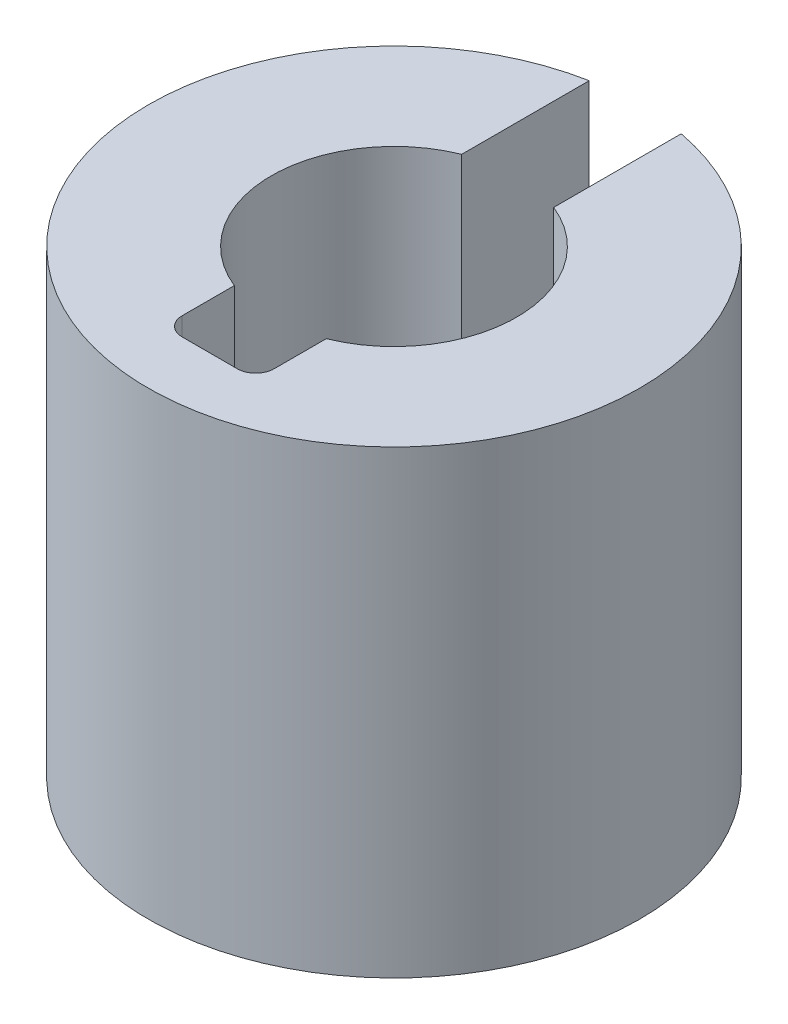
ISO-10303-21;
HEADER;
FILE_DESCRIPTION(('STEP AP214'),'2;1');
FILE_NAME('part.step','',(''),(''),'','','');
FILE_SCHEMA(('AUTOMOTIVE_DESIGN { 1 0 10303 214 1 1 1 1 }'));
ENDSEC;
DATA;
#1=APPLICATION_CONTEXT('core data for automotive mechanical design processes');
#2=APPLICATION_PROTOCOL_DEFINITION('international standard','automotive_design',2000,#1);
#3=PRODUCT_CONTEXT('',#1,'mechanical');
#4=PRODUCT('Part','Part','',(#3));
#5=PRODUCT_RELATED_PRODUCT_CATEGORY('part','',(#4));
#6=PRODUCT_DEFINITION_FORMATION('','',#4);
#7=PRODUCT_DEFINITION_CONTEXT('part definition',#1,'design');
#8=PRODUCT_DEFINITION('design','',#6,#7);
#9=PRODUCT_DEFINITION_SHAPE('','',#8);
#10=(LENGTH_UNIT() NAMED_UNIT(*) SI_UNIT(.MILLI.,.METRE.));
#11=(NAMED_UNIT(*) PLANE_ANGLE_UNIT() SI_UNIT($,.RADIAN.));
#12=(NAMED_UNIT(*) SI_UNIT($,.STERADIAN.) SOLID_ANGLE_UNIT());
#13=UNCERTAINTY_MEASURE_WITH_UNIT(LENGTH_MEASURE(1.E-05),#10,'distance_accuracy_value','');
#14=(GEOMETRIC_REPRESENTATION_CONTEXT(3) GLOBAL_UNCERTAINTY_ASSIGNED_CONTEXT((#13)) GLOBAL_UNIT_ASSIGNED_CONTEXT((#10,
#11,#12)) REPRESENTATION_CONTEXT('',''));
#15=CARTESIAN_POINT('',(0.,0.,0.));
#16=DIRECTION('',(0.,0.,1.));
#17=DIRECTION('',(1.,0.,0.));
#18=AXIS2_PLACEMENT_3D('',#15,#16,#17);
#19=CARTESIAN_POINT('',(0.45,3.75,2.705));
#20=DIRECTION('',(0.,1.,0.));
#21=DIRECTION('',(0.,0.,1.));
#22=AXIS2_PLACEMENT_3D('',#19,#20,#21);
#23=CYLINDRICAL_SURFACE('',#22,0.3);
#24=CARTESIAN_POINT('',(0.45,3.75,2.705));
#25=DIRECTION('',(0.,-1.,0.));
#26=DIRECTION('',(0.,0.,1.));
#27=AXIS2_PLACEMENT_3D('',#24,#25,#26);
#28=CIRCLE('',#27,0.3);
#29=CARTESIAN_POINT('',(0.75,3.75,2.705));
#30=VERTEX_POINT('',#29);
#31=CARTESIAN_POINT('',(0.45,3.75,3.005));
#32=VERTEX_POINT('',#31);
#33=EDGE_CURVE('E153',#30,#32,#28,.T.);
#34=ORIENTED_EDGE('',*,*,#33,.F.);
#35=DIRECTION('',(0.,1.,0.));
#36=VECTOR('',#35,1.);
#37=CARTESIAN_POINT('',(0.75,3.75,2.705));
#38=LINE('',#37,#36);
#39=CARTESIAN_POINT('',(0.75,-3.75,2.705));
#40=VERTEX_POINT('',#39);
#41=EDGE_CURVE('E126',#40,#30,#38,.T.);
#42=ORIENTED_EDGE('',*,*,#41,.F.);
#43=CARTESIAN_POINT('',(0.45,-3.75,2.705));
#44=DIRECTION('',(0.,1.,0.));
#45=DIRECTION('',(0.,0.,1.));
#46=AXIS2_PLACEMENT_3D('',#43,#44,#45);
#47=CIRCLE('',#46,0.3);
#48=CARTESIAN_POINT('',(0.45,-3.75,3.005));
#49=VERTEX_POINT('',#48);
#50=EDGE_CURVE('E11',#49,#40,#47,.T.);
#51=ORIENTED_EDGE('',*,*,#50,.F.);
#52=DIRECTION('',(0.,-1.,0.));
#53=VECTOR('',#52,1.);
#54=CARTESIAN_POINT('',(0.45,-3.75,3.005));
#55=LINE('',#54,#53);
#56=EDGE_CURVE('E152',#32,#49,#55,.T.);
#57=ORIENTED_EDGE('',*,*,#56,.F.);
#58=EDGE_LOOP('',(#34,#42,#51,#57));
#59=FACE_BOUND('',#58,.T.);
#60=ADVANCED_FACE('F16',(#59),#23,.F.);
#61=CARTESIAN_POINT('',(-0.45,3.75,2.705));
#62=DIRECTION('',(0.,1.,0.));
#63=DIRECTION('',(0.,0.,1.));
#64=AXIS2_PLACEMENT_3D('',#61,#62,#63);
#65=CYLINDRICAL_SURFACE('',#64,0.3);
#66=CARTESIAN_POINT('',(-0.45,3.75,2.705));
#67=DIRECTION('',(0.,-1.,0.));
#68=DIRECTION('',(0.,0.,1.));
#69=AXIS2_PLACEMENT_3D('',#66,#67,#68);
#70=CIRCLE('',#69,0.3);
#71=CARTESIAN_POINT('',(-0.45,3.75,3.005));
#72=VERTEX_POINT('',#71);
#73=CARTESIAN_POINT('',(-0.75,3.75,2.705));
#74=VERTEX_POINT('',#73);
#75=EDGE_CURVE('E20',#72,#74,#70,.T.);
#76=ORIENTED_EDGE('',*,*,#75,.F.);
#77=DIRECTION('',(0.,1.,0.));
#78=VECTOR('',#77,1.);
#79=CARTESIAN_POINT('',(-0.45,3.75,3.005));
#80=LINE('',#79,#78);
#81=CARTESIAN_POINT('',(-0.45,-3.75,3.005));
#82=VERTEX_POINT('',#81);
#83=EDGE_CURVE('E176',#82,#72,#80,.T.);
#84=ORIENTED_EDGE('',*,*,#83,.F.);
#85=CARTESIAN_POINT('',(-0.45,-3.75,2.705));
#86=DIRECTION('',(0.,1.,0.));
#87=DIRECTION('',(0.,0.,1.));
#88=AXIS2_PLACEMENT_3D('',#85,#86,#87);
#89=CIRCLE('',#88,0.3);
#90=CARTESIAN_POINT('',(-0.75,-3.75,2.705));
#91=VERTEX_POINT('',#90);
#92=EDGE_CURVE('E27',#91,#82,#89,.T.);
#93=ORIENTED_EDGE('',*,*,#92,.F.);
#94=DIRECTION('',(0.,-1.,0.));
#95=VECTOR('',#94,1.);
#96=CARTESIAN_POINT('',(-0.75,-3.75,2.705));
#97=LINE('',#96,#95);
#98=EDGE_CURVE('E161',#74,#91,#97,.T.);
#99=ORIENTED_EDGE('',*,*,#98,.F.);
#100=EDGE_LOOP('',(#76,#84,#93,#99));
#101=FACE_BOUND('',#100,.T.);
#102=ADVANCED_FACE('F235',(#101),#65,.F.);
#103=CARTESIAN_POINT('',(0.,-3.75,0.));
#104=DIRECTION('',(0.,1.,0.));
#105=DIRECTION('',(1.,0.,0.));
#106=AXIS2_PLACEMENT_3D('',#103,#104,#105);
#107=PLANE('',#106);
#108=CARTESIAN_POINT('',(0.,-3.75,0.));
#109=DIRECTION('',(0.,-1.,0.));
#110=DIRECTION('',(0.,0.,1.));
#111=AXIS2_PLACEMENT_3D('',#108,#109,#110);
#112=CIRCLE('',#111,2.);
#113=CARTESIAN_POINT('',(0.75,-3.75,-1.85404962177392));
#114=VERTEX_POINT('',#113);
#115=CARTESIAN_POINT('',(0.75,-3.75,1.85404962177392));
#116=VERTEX_POINT('',#115);
#117=EDGE_CURVE('E142',#114,#116,#112,.T.);
#118=ORIENTED_EDGE('',*,*,#117,.F.);
#119=DIRECTION('',(0.,0.,1.));
#120=VECTOR('',#119,1.);
#121=CARTESIAN_POINT('',(0.75,-3.75,-1.85404962177392));
#122=LINE('',#121,#120);
#123=CARTESIAN_POINT('',(0.75,-3.75,-3.93414857370689));
#124=VERTEX_POINT('',#123);
#125=EDGE_CURVE('E190',#124,#114,#122,.T.);
#126=ORIENTED_EDGE('',*,*,#125,.F.);
#127=CARTESIAN_POINT('',(0.,-3.75,0.));
#128=DIRECTION('',(0.,1.,0.));
#129=DIRECTION('',(0.,0.,1.));
#130=AXIS2_PLACEMENT_3D('',#127,#128,#129);
#131=CIRCLE('',#130,4.005);
#132=CARTESIAN_POINT('',(-0.75,-3.75,-3.93414857370689));
#133=VERTEX_POINT('',#132);
#134=EDGE_CURVE('E184',#133,#124,#131,.T.);
#135=ORIENTED_EDGE('',*,*,#134,.F.);
#136=DIRECTION('',(0.,0.,-1.));
#137=VECTOR('',#136,1.);
#138=CARTESIAN_POINT('',(-0.75,-3.75,-1.85404962177392));
#139=LINE('',#138,#137);
#140=CARTESIAN_POINT('',(-0.75,-3.75,-1.85404962177392));
#141=VERTEX_POINT('',#140);
#142=EDGE_CURVE('E170',#141,#133,#139,.T.);
#143=ORIENTED_EDGE('',*,*,#142,.F.);
#144=CARTESIAN_POINT('',(0.,-3.75,0.));
#145=DIRECTION('',(0.,-1.,0.));
#146=DIRECTION('',(0.,0.,1.));
#147=AXIS2_PLACEMENT_3D('',#144,#145,#146);
#148=CIRCLE('',#147,2.);
#149=CARTESIAN_POINT('',(-0.75,-3.75,1.85404962177392));
#150=VERTEX_POINT('',#149);
#151=EDGE_CURVE('E165',#150,#141,#148,.T.);
#152=ORIENTED_EDGE('',*,*,#151,.F.);
#153=DIRECTION('',(0.,0.,-1.));
#154=VECTOR('',#153,1.);
#155=CARTESIAN_POINT('',(-0.75,-3.75,3.005));
#156=LINE('',#155,#154);
#157=EDGE_CURVE('E156',#91,#150,#156,.T.);
#158=ORIENTED_EDGE('',*,*,#157,.F.);
#159=ORIENTED_EDGE('',*,*,#92,.T.);
#160=DIRECTION('',(-1.,0.,0.));
#161=VECTOR('',#160,1.);
#162=CARTESIAN_POINT('',(-0.75,-3.75,3.005));
#163=LINE('',#162,#161);
#164=EDGE_CURVE('E130',#49,#82,#163,.T.);
#165=ORIENTED_EDGE('',*,*,#164,.F.);
#166=ORIENTED_EDGE('',*,*,#50,.T.);
#167=DIRECTION('',(0.,0.,1.));
#168=VECTOR('',#167,1.);
#169=CARTESIAN_POINT('',(0.75,-3.75,3.005));
#170=LINE('',#169,#168);
#171=EDGE_CURVE('E195',#116,#40,#170,.T.);
#172=ORIENTED_EDGE('',*,*,#171,.F.);
#173=EDGE_LOOP('',(#118,#126,#135,#143,#152,#158,#159,#165,#166,#172));
#174=FACE_BOUND('',#173,.T.);
#175=ADVANCED_FACE('F248',(#174),#107,.F.);
#176=CARTESIAN_POINT('',(0.,3.75,0.));
#177=DIRECTION('',(0.,1.,0.));
#178=DIRECTION('',(1.,0.,0.));
#179=AXIS2_PLACEMENT_3D('',#176,#177,#178);
#180=PLANE('',#179);
#181=CARTESIAN_POINT('',(0.,3.75,0.));
#182=DIRECTION('',(0.,-1.,0.));
#183=DIRECTION('',(0.,0.,1.));
#184=AXIS2_PLACEMENT_3D('',#181,#182,#183);
#185=CIRCLE('',#184,2.);
#186=CARTESIAN_POINT('',(0.75,3.75,-1.85404962177392));
#187=VERTEX_POINT('',#186);
#188=CARTESIAN_POINT('',(0.75,3.75,1.85404962177392));
#189=VERTEX_POINT('',#188);
#190=EDGE_CURVE('E133',#187,#189,#185,.T.);
#191=ORIENTED_EDGE('',*,*,#190,.T.);
#192=DIRECTION('',(0.,0.,1.));
#193=VECTOR('',#192,1.);
#194=CARTESIAN_POINT('',(0.75,3.75,3.005));
#195=LINE('',#194,#193);
#196=EDGE_CURVE('E118',#189,#30,#195,.T.);
#197=ORIENTED_EDGE('',*,*,#196,.T.);
#198=ORIENTED_EDGE('',*,*,#33,.T.);
#199=DIRECTION('',(-1.,0.,0.));
#200=VECTOR('',#199,1.);
#201=CARTESIAN_POINT('',(-0.75,3.75,3.005));
#202=LINE('',#201,#200);
#203=EDGE_CURVE('E180',#32,#72,#202,.T.);
#204=ORIENTED_EDGE('',*,*,#203,.T.);
#205=ORIENTED_EDGE('',*,*,#75,.T.);
#206=DIRECTION('',(0.,0.,-1.));
#207=VECTOR('',#206,1.);
#208=CARTESIAN_POINT('',(-0.75,3.75,3.005));
#209=LINE('',#208,#207);
#210=CARTESIAN_POINT('',(-0.75,3.75,1.85404962177392));
#211=VERTEX_POINT('',#210);
#212=EDGE_CURVE('E186',#74,#211,#209,.T.);
#213=ORIENTED_EDGE('',*,*,#212,.T.);
#214=CARTESIAN_POINT('',(0.,3.75,0.));
#215=DIRECTION('',(0.,-1.,0.));
#216=DIRECTION('',(0.,0.,1.));
#217=AXIS2_PLACEMENT_3D('',#214,#215,#216);
#218=CIRCLE('',#217,2.);
#219=CARTESIAN_POINT('',(-0.75,3.75,-1.85404962177392));
#220=VERTEX_POINT('',#219);
#221=EDGE_CURVE('E175',#211,#220,#218,.T.);
#222=ORIENTED_EDGE('',*,*,#221,.T.);
#223=DIRECTION('',(0.,0.,-1.));
#224=VECTOR('',#223,1.);
#225=CARTESIAN_POINT('',(-0.75,3.75,-1.85404962177392));
#226=LINE('',#225,#224);
#227=CARTESIAN_POINT('',(-0.75,3.75,-3.93414857370689));
#228=VERTEX_POINT('',#227);
#229=EDGE_CURVE('E204',#220,#228,#226,.T.);
#230=ORIENTED_EDGE('',*,*,#229,.T.);
#231=CARTESIAN_POINT('',(0.,3.75,0.));
#232=DIRECTION('',(0.,1.,0.));
#233=DIRECTION('',(0.,0.,1.));
#234=AXIS2_PLACEMENT_3D('',#231,#232,#233);
#235=CIRCLE('',#234,4.005);
#236=CARTESIAN_POINT('',(0.75,3.75,-3.93414857370689));
#237=VERTEX_POINT('',#236);
#238=EDGE_CURVE('E183',#228,#237,#235,.T.);
#239=ORIENTED_EDGE('',*,*,#238,.T.);
#240=DIRECTION('',(0.,0.,1.));
#241=VECTOR('',#240,1.);
#242=CARTESIAN_POINT('',(0.75,3.75,-1.85404962177392));
#243=LINE('',#242,#241);
#244=EDGE_CURVE('E41',#237,#187,#243,.T.);
#245=ORIENTED_EDGE('',*,*,#244,.T.);
#246=EDGE_LOOP('',(#191,#197,#198,#204,#205,#213,#222,#230,#239,#245));
#247=FACE_BOUND('',#246,.T.);
#248=ADVANCED_FACE('F134',(#247),#180,.T.);
#249=CARTESIAN_POINT('',(0.75,3.75,-1.85404962177392));
#250=DIRECTION('',(1.,0.,0.));
#251=DIRECTION('',(0.,1.,0.));
#252=AXIS2_PLACEMENT_3D('',#249,#250,#251);
#253=PLANE('',#252);
#254=ORIENTED_EDGE('',*,*,#125,.T.);
#255=DIRECTION('',(0.,-1.,0.));
#256=VECTOR('',#255,1.);
#257=CARTESIAN_POINT('',(0.75,3.75,-1.85404962177392));
#258=LINE('',#257,#256);
#259=EDGE_CURVE('E138',#187,#114,#258,.T.);
#260=ORIENTED_EDGE('',*,*,#259,.F.);
#261=ORIENTED_EDGE('',*,*,#244,.F.);
#262=DIRECTION('',(0.,-1.,0.));
#263=VECTOR('',#262,1.);
#264=CARTESIAN_POINT('',(0.75,3.75,-3.93414857370689));
#265=LINE('',#264,#263);
#266=EDGE_CURVE('E181',#237,#124,#265,.T.);
#267=ORIENTED_EDGE('',*,*,#266,.T.);
#268=EDGE_LOOP('',(#254,#260,#261,#267));
#269=FACE_BOUND('',#268,.T.);
#270=ADVANCED_FACE('F18',(#269),#253,.F.);
#271=CARTESIAN_POINT('',(0.,3.75,0.));
#272=DIRECTION('',(0.,-1.,0.));
#273=DIRECTION('',(0.,0.,-1.));
#274=AXIS2_PLACEMENT_3D('',#271,#272,#273);
#275=CYLINDRICAL_SURFACE('',#274,4.005);
#276=ORIENTED_EDGE('',*,*,#134,.T.);
#277=ORIENTED_EDGE('',*,*,#266,.F.);
#278=ORIENTED_EDGE('',*,*,#238,.F.);
#279=DIRECTION('',(0.,-1.,0.));
#280=VECTOR('',#279,1.);
#281=CARTESIAN_POINT('',(-0.75,3.75,-3.93414857370689));
#282=LINE('',#281,#280);
#283=EDGE_CURVE('E174',#228,#133,#282,.T.);
#284=ORIENTED_EDGE('',*,*,#283,.T.);
#285=EDGE_LOOP('',(#276,#277,#278,#284));
#286=FACE_BOUND('',#285,.T.);
#287=ADVANCED_FACE('F247',(#286),#275,.T.);
#288=CARTESIAN_POINT('',(-0.75,3.75,-1.85404962177392));
#289=DIRECTION('',(-1.,0.,0.));
#290=DIRECTION('',(0.,0.,1.));
#291=AXIS2_PLACEMENT_3D('',#288,#289,#290);
#292=PLANE('',#291);
#293=ORIENTED_EDGE('',*,*,#142,.T.);
#294=ORIENTED_EDGE('',*,*,#283,.F.);
#295=ORIENTED_EDGE('',*,*,#229,.F.);
#296=DIRECTION('',(0.,-1.,0.));
#297=VECTOR('',#296,1.);
#298=CARTESIAN_POINT('',(-0.75,3.75,-1.85404962177392));
#299=LINE('',#298,#297);
#300=EDGE_CURVE('E169',#220,#141,#299,.T.);
#301=ORIENTED_EDGE('',*,*,#300,.T.);
#302=EDGE_LOOP('',(#293,#294,#295,#301));
#303=FACE_BOUND('',#302,.T.);
#304=ADVANCED_FACE('F245',(#303),#292,.F.);
#305=CARTESIAN_POINT('',(0.,3.75,0.));
#306=DIRECTION('',(0.,-1.,0.));
#307=DIRECTION('',(0.,0.,-1.));
#308=AXIS2_PLACEMENT_3D('',#305,#306,#307);
#309=CYLINDRICAL_SURFACE('',#308,2.);
#310=ORIENTED_EDGE('',*,*,#151,.T.);
#311=ORIENTED_EDGE('',*,*,#300,.F.);
#312=ORIENTED_EDGE('',*,*,#221,.F.);
#313=DIRECTION('',(0.,-1.,0.));
#314=VECTOR('',#313,1.);
#315=CARTESIAN_POINT('',(-0.75,3.75,1.85404962177392));
#316=LINE('',#315,#314);
#317=EDGE_CURVE('E160',#211,#150,#316,.T.);
#318=ORIENTED_EDGE('',*,*,#317,.T.);
#319=EDGE_LOOP('',(#310,#311,#312,#318));
#320=FACE_BOUND('',#319,.T.);
#321=ADVANCED_FACE('F240',(#320),#309,.F.);
#322=CARTESIAN_POINT('',(-0.75,3.75,3.005));
#323=DIRECTION('',(-1.,0.,0.));
#324=DIRECTION('',(0.,0.,1.));
#325=AXIS2_PLACEMENT_3D('',#322,#323,#324);
#326=PLANE('',#325);
#327=ORIENTED_EDGE('',*,*,#212,.F.);
#328=ORIENTED_EDGE('',*,*,#98,.T.);
#329=ORIENTED_EDGE('',*,*,#157,.T.);
#330=ORIENTED_EDGE('',*,*,#317,.F.);
#331=EDGE_LOOP('',(#327,#328,#329,#330));
#332=FACE_BOUND('',#331,.T.);
#333=ADVANCED_FACE('F238',(#332),#326,.F.);
#334=CARTESIAN_POINT('',(-0.75,3.75,3.005));
#335=DIRECTION('',(0.,0.,1.));
#336=DIRECTION('',(1.,0.,0.));
#337=AXIS2_PLACEMENT_3D('',#334,#335,#336);
#338=PLANE('',#337);
#339=ORIENTED_EDGE('',*,*,#164,.T.);
#340=ORIENTED_EDGE('',*,*,#83,.T.);
#341=ORIENTED_EDGE('',*,*,#203,.F.);
#342=ORIENTED_EDGE('',*,*,#56,.T.);
#343=EDGE_LOOP('',(#339,#340,#341,#342));
#344=FACE_BOUND('',#343,.T.);
#345=ADVANCED_FACE('F364',(#344),#338,.F.);
#346=CARTESIAN_POINT('',(0.75,3.75,3.005));
#347=DIRECTION('',(1.,0.,0.));
#348=DIRECTION('',(0.,1.,0.));
#349=AXIS2_PLACEMENT_3D('',#346,#347,#348);
#350=PLANE('',#349);
#351=ORIENTED_EDGE('',*,*,#171,.T.);
#352=ORIENTED_EDGE('',*,*,#41,.T.);
#353=ORIENTED_EDGE('',*,*,#196,.F.);
#354=DIRECTION('',(0.,-1.,0.));
#355=VECTOR('',#354,1.);
#356=CARTESIAN_POINT('',(0.75,3.75,1.85404962177392));
#357=LINE('',#356,#355);
#358=EDGE_CURVE('E123',#189,#116,#357,.T.);
#359=ORIENTED_EDGE('',*,*,#358,.T.);
#360=EDGE_LOOP('',(#351,#352,#353,#359));
#361=FACE_BOUND('',#360,.T.);
#362=ADVANCED_FACE('F121',(#361),#350,.F.);
#363=CARTESIAN_POINT('',(0.,3.75,0.));
#364=DIRECTION('',(0.,-1.,0.));
#365=DIRECTION('',(0.,0.,-1.));
#366=AXIS2_PLACEMENT_3D('',#363,#364,#365);
#367=CYLINDRICAL_SURFACE('',#366,2.);
#368=ORIENTED_EDGE('',*,*,#117,.T.);
#369=ORIENTED_EDGE('',*,*,#358,.F.);
#370=ORIENTED_EDGE('',*,*,#190,.F.);
#371=ORIENTED_EDGE('',*,*,#259,.T.);
#372=EDGE_LOOP('',(#368,#369,#370,#371));
#373=FACE_BOUND('',#372,.T.);
#374=ADVANCED_FACE('F140',(#373),#367,.F.);
#375=CLOSED_SHELL('',(#60,#102,#175,#248,#270,#287,#304,#321,#333,#345,#362,#374));
#376=MANIFOLD_SOLID_BREP('B1',#375);
#377=ADVANCED_BREP_SHAPE_REPRESENTATION('',(#18,#376),#14);
#378=SHAPE_DEFINITION_REPRESENTATION(#9,#377);
ENDSEC;
END-ISO-10303-21;
